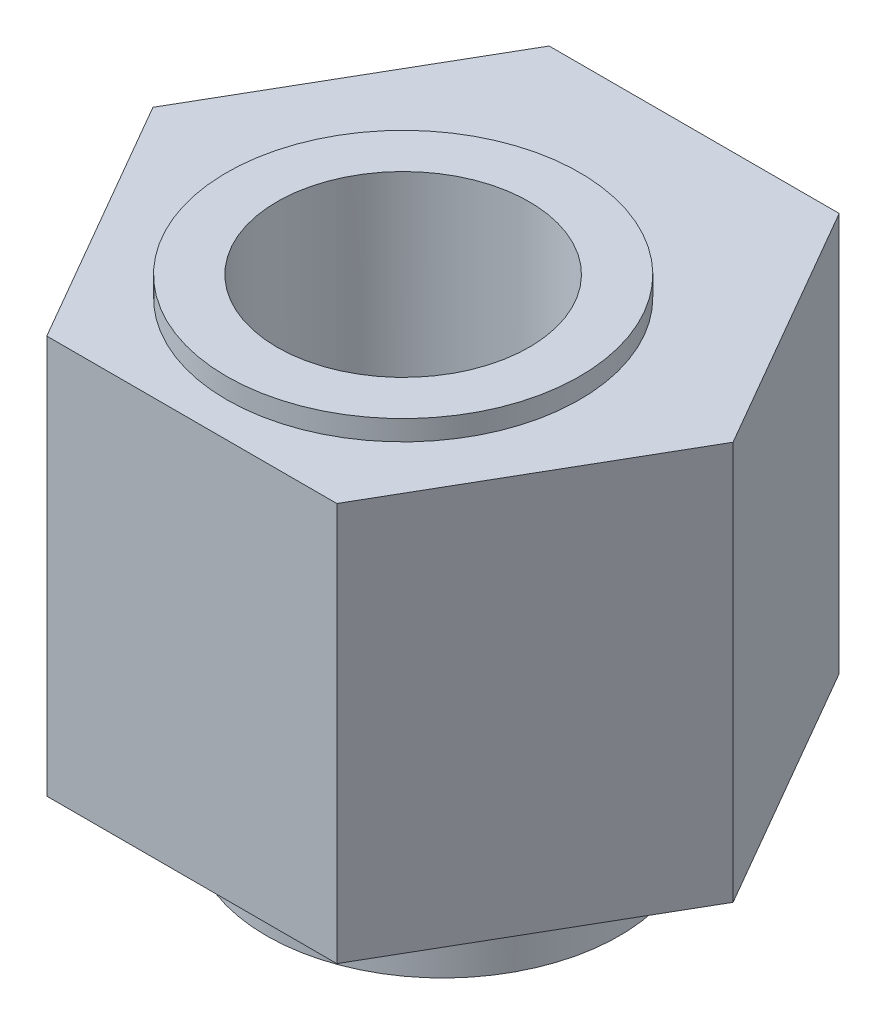
ISO-10303-21;
HEADER;
FILE_DESCRIPTION(('STEP AP214'),'2;1');
FILE_NAME('part.step','',(''),(''),'','','');
FILE_SCHEMA(('AUTOMOTIVE_DESIGN { 1 0 10303 214 1 1 1 1 }'));
ENDSEC;
DATA;
#1=APPLICATION_CONTEXT('core data for automotive mechanical design processes');
#2=APPLICATION_PROTOCOL_DEFINITION('international standard','automotive_design',2000,#1);
#3=PRODUCT_CONTEXT('',#1,'mechanical');
#4=PRODUCT('Part','Part','',(#3));
#5=PRODUCT_RELATED_PRODUCT_CATEGORY('part','',(#4));
#6=PRODUCT_DEFINITION_FORMATION('','',#4);
#7=PRODUCT_DEFINITION_CONTEXT('part definition',#1,'design');
#8=PRODUCT_DEFINITION('design','',#6,#7);
#9=PRODUCT_DEFINITION_SHAPE('','',#8);
#10=(LENGTH_UNIT() NAMED_UNIT(*) SI_UNIT(.MILLI.,.METRE.));
#11=(NAMED_UNIT(*) PLANE_ANGLE_UNIT() SI_UNIT($,.RADIAN.));
#12=(NAMED_UNIT(*) SI_UNIT($,.STERADIAN.) SOLID_ANGLE_UNIT());
#13=UNCERTAINTY_MEASURE_WITH_UNIT(LENGTH_MEASURE(1.E-05),#10,'distance_accuracy_value','');
#14=(GEOMETRIC_REPRESENTATION_CONTEXT(3) GLOBAL_UNCERTAINTY_ASSIGNED_CONTEXT((#13)) GLOBAL_UNIT_ASSIGNED_CONTEXT((#10,
#11,#12)) REPRESENTATION_CONTEXT('',''));
#15=CARTESIAN_POINT('',(0.,0.,0.));
#16=DIRECTION('',(0.,0.,1.));
#17=DIRECTION('',(1.,0.,0.));
#18=AXIS2_PLACEMENT_3D('',#15,#16,#17);
#19=CARTESIAN_POINT('',(0.,0.,0.));
#20=DIRECTION('',(0.,1.,0.));
#21=DIRECTION('',(0.,0.,1.));
#22=AXIS2_PLACEMENT_3D('',#19,#20,#21);
#23=PLANE('',#22);
#24=DIRECTION('',(0.5,0.,-0.866025403784439));
#25=VECTOR('',#24,1.);
#26=CARTESIAN_POINT('',(2.87520434056434,0.,4.98));
#27=LINE('',#26,#25);
#28=CARTESIAN_POINT('',(2.87520434056434,0.,4.98));
#29=VERTEX_POINT('',#28);
#30=CARTESIAN_POINT('',(5.75040868112867,0.,0.));
#31=VERTEX_POINT('',#30);
#32=EDGE_CURVE('E121',#29,#31,#27,.T.);
#33=ORIENTED_EDGE('',*,*,#32,.F.);
#34=DIRECTION('',(1.,0.,0.));
#35=VECTOR('',#34,1.);
#36=CARTESIAN_POINT('',(-2.87520434056433,0.,4.98));
#37=LINE('',#36,#35);
#38=CARTESIAN_POINT('',(-2.87520434056433,0.,4.98));
#39=VERTEX_POINT('',#38);
#40=EDGE_CURVE('E80',#39,#29,#37,.T.);
#41=ORIENTED_EDGE('',*,*,#40,.F.);
#42=DIRECTION('',(0.5,0.,0.866025403784439));
#43=VECTOR('',#42,1.);
#44=CARTESIAN_POINT('',(-5.75040868112867,0.,0.));
#45=LINE('',#44,#43);
#46=CARTESIAN_POINT('',(-5.75040868112867,0.,0.));
#47=VERTEX_POINT('',#46);
#48=EDGE_CURVE('E74',#47,#39,#45,.T.);
#49=ORIENTED_EDGE('',*,*,#48,.F.);
#50=DIRECTION('',(-0.5,0.,0.866025403784439));
#51=VECTOR('',#50,1.);
#52=CARTESIAN_POINT('',(-2.87520434056433,0.,-4.98));
#53=LINE('',#52,#51);
#54=CARTESIAN_POINT('',(-2.87520434056433,0.,-4.98));
#55=VERTEX_POINT('',#54);
#56=EDGE_CURVE('E111',#55,#47,#53,.T.);
#57=ORIENTED_EDGE('',*,*,#56,.F.);
#58=DIRECTION('',(-1.,0.,0.));
#59=VECTOR('',#58,1.);
#60=CARTESIAN_POINT('',(2.87520434056434,0.,-4.98));
#61=LINE('',#60,#59);
#62=CARTESIAN_POINT('',(2.87520434056434,0.,-4.98));
#63=VERTEX_POINT('',#62);
#64=EDGE_CURVE('E127',#63,#55,#61,.T.);
#65=ORIENTED_EDGE('',*,*,#64,.F.);
#66=DIRECTION('',(-0.5,0.,-0.866025403784438));
#67=VECTOR('',#66,1.);
#68=CARTESIAN_POINT('',(5.75040868112867,0.,0.));
#69=LINE('',#68,#67);
#70=EDGE_CURVE('E124',#31,#63,#69,.T.);
#71=ORIENTED_EDGE('',*,*,#70,.F.);
#72=EDGE_LOOP('',(#33,#41,#49,#57,#65,#71));
#73=FACE_BOUND('',#72,.T.);
#74=CARTESIAN_POINT('',(0.,0.,0.));
#75=DIRECTION('',(0.,1.,0.));
#76=DIRECTION('',(0.,0.,1.));
#77=AXIS2_PLACEMENT_3D('',#74,#75,#76);
#78=CIRCLE('',#77,3.5);
#79=CARTESIAN_POINT('',(0.,0.,3.5));
#80=VERTEX_POINT('',#79);
#81=EDGE_CURVE('E11',#80,#80,#78,.F.);
#82=ORIENTED_EDGE('',*,*,#81,.F.);
#83=EDGE_LOOP('',(#82));
#84=FACE_BOUND('',#83,.T.);
#85=ADVANCED_FACE('F34',(#73,#84),#23,.F.);
#86=CARTESIAN_POINT('',(0.,7.9,0.));
#87=DIRECTION('',(0.,1.,0.));
#88=DIRECTION('',(0.,0.,1.));
#89=AXIS2_PLACEMENT_3D('',#86,#87,#88);
#90=PLANE('',#89);
#91=DIRECTION('',(0.5,0.,-0.866025403784439));
#92=VECTOR('',#91,1.);
#93=CARTESIAN_POINT('',(2.87520434056434,7.9,4.98));
#94=LINE('',#93,#92);
#95=CARTESIAN_POINT('',(2.87520434056434,7.9,4.98));
#96=VERTEX_POINT('',#95);
#97=CARTESIAN_POINT('',(5.75040868112867,7.9,0.));
#98=VERTEX_POINT('',#97);
#99=EDGE_CURVE('E132',#96,#98,#94,.T.);
#100=ORIENTED_EDGE('',*,*,#99,.T.);
#101=DIRECTION('',(-0.5,0.,-0.866025403784438));
#102=VECTOR('',#101,1.);
#103=CARTESIAN_POINT('',(5.75040868112867,7.9,0.));
#104=LINE('',#103,#102);
#105=CARTESIAN_POINT('',(2.87520434056434,7.9,-4.98));
#106=VERTEX_POINT('',#105);
#107=EDGE_CURVE('E89',#98,#106,#104,.T.);
#108=ORIENTED_EDGE('',*,*,#107,.T.);
#109=DIRECTION('',(-1.,0.,0.));
#110=VECTOR('',#109,1.);
#111=CARTESIAN_POINT('',(2.87520434056434,7.9,-4.98));
#112=LINE('',#111,#110);
#113=CARTESIAN_POINT('',(-2.87520434056433,7.9,-4.98));
#114=VERTEX_POINT('',#113);
#115=EDGE_CURVE('E103',#106,#114,#112,.T.);
#116=ORIENTED_EDGE('',*,*,#115,.T.);
#117=DIRECTION('',(-0.5,0.,0.866025403784439));
#118=VECTOR('',#117,1.);
#119=CARTESIAN_POINT('',(-2.87520434056433,7.9,-4.98));
#120=LINE('',#119,#118);
#121=CARTESIAN_POINT('',(-5.75040868112867,7.9,0.));
#122=VERTEX_POINT('',#121);
#123=EDGE_CURVE('E96',#114,#122,#120,.T.);
#124=ORIENTED_EDGE('',*,*,#123,.T.);
#125=DIRECTION('',(0.5,0.,0.866025403784439));
#126=VECTOR('',#125,1.);
#127=CARTESIAN_POINT('',(-5.75040868112867,7.9,0.));
#128=LINE('',#127,#126);
#129=CARTESIAN_POINT('',(-2.87520434056433,7.9,4.98));
#130=VERTEX_POINT('',#129);
#131=EDGE_CURVE('E101',#122,#130,#128,.T.);
#132=ORIENTED_EDGE('',*,*,#131,.T.);
#133=DIRECTION('',(1.,0.,0.));
#134=VECTOR('',#133,1.);
#135=CARTESIAN_POINT('',(-2.87520434056433,7.9,4.98));
#136=LINE('',#135,#134);
#137=EDGE_CURVE('E51',#130,#96,#136,.T.);
#138=ORIENTED_EDGE('',*,*,#137,.T.);
#139=EDGE_LOOP('',(#100,#108,#116,#124,#132,#138));
#140=FACE_BOUND('',#139,.T.);
#141=CARTESIAN_POINT('',(0.,7.9,0.79));
#142=DIRECTION('',(0.,1.,0.));
#143=DIRECTION('',(0.,0.,1.));
#144=AXIS2_PLACEMENT_3D('',#141,#142,#143);
#145=CIRCLE('',#144,3.5);
#146=CARTESIAN_POINT('',(0.,7.9,4.29));
#147=VERTEX_POINT('',#146);
#148=EDGE_CURVE('E151',#147,#147,#145,.T.);
#149=ORIENTED_EDGE('',*,*,#148,.F.);
#150=EDGE_LOOP('',(#149));
#151=FACE_BOUND('',#150,.T.);
#152=ADVANCED_FACE('F98',(#140,#151),#90,.T.);
#153=CARTESIAN_POINT('',(2.87520434056434,7.9,4.98));
#154=DIRECTION('',(-0.866025403784439,0.,-0.5));
#155=DIRECTION('',(-0.5,0.,0.866025403784439));
#156=AXIS2_PLACEMENT_3D('',#153,#154,#155);
#157=PLANE('',#156);
#158=ORIENTED_EDGE('',*,*,#32,.T.);
#159=DIRECTION('',(0.,-1.,0.));
#160=VECTOR('',#159,1.);
#161=CARTESIAN_POINT('',(5.75040868112867,7.9,0.));
#162=LINE('',#161,#160);
#163=EDGE_CURVE('E43',#98,#31,#162,.T.);
#164=ORIENTED_EDGE('',*,*,#163,.F.);
#165=ORIENTED_EDGE('',*,*,#99,.F.);
#166=DIRECTION('',(0.,-1.,0.));
#167=VECTOR('',#166,1.);
#168=CARTESIAN_POINT('',(2.87520434056434,7.9,4.98));
#169=LINE('',#168,#167);
#170=EDGE_CURVE('E117',#96,#29,#169,.T.);
#171=ORIENTED_EDGE('',*,*,#170,.T.);
#172=EDGE_LOOP('',(#158,#164,#165,#171));
#173=FACE_BOUND('',#172,.T.);
#174=ADVANCED_FACE('F36',(#173),#157,.F.);
#175=CARTESIAN_POINT('',(5.75040868112867,7.9,0.));
#176=DIRECTION('',(-0.866025403784438,0.,0.5));
#177=DIRECTION('',(0.5,0.,0.866025403784438));
#178=AXIS2_PLACEMENT_3D('',#175,#176,#177);
#179=PLANE('',#178);
#180=ORIENTED_EDGE('',*,*,#70,.T.);
#181=DIRECTION('',(0.,-1.,0.));
#182=VECTOR('',#181,1.);
#183=CARTESIAN_POINT('',(2.87520434056434,7.9,-4.98));
#184=LINE('',#183,#182);
#185=EDGE_CURVE('E136',#106,#63,#184,.T.);
#186=ORIENTED_EDGE('',*,*,#185,.F.);
#187=ORIENTED_EDGE('',*,*,#107,.F.);
#188=ORIENTED_EDGE('',*,*,#163,.T.);
#189=EDGE_LOOP('',(#180,#186,#187,#188));
#190=FACE_BOUND('',#189,.T.);
#191=ADVANCED_FACE('F139',(#190),#179,.F.);
#192=CARTESIAN_POINT('',(2.87520434056434,7.9,-4.98));
#193=DIRECTION('',(0.,0.,1.));
#194=DIRECTION('',(1.,0.,0.));
#195=AXIS2_PLACEMENT_3D('',#192,#193,#194);
#196=PLANE('',#195);
#197=ORIENTED_EDGE('',*,*,#64,.T.);
#198=DIRECTION('',(0.,-1.,0.));
#199=VECTOR('',#198,1.);
#200=CARTESIAN_POINT('',(-2.87520434056433,7.9,-4.98));
#201=LINE('',#200,#199);
#202=EDGE_CURVE('E112',#114,#55,#201,.T.);
#203=ORIENTED_EDGE('',*,*,#202,.F.);
#204=ORIENTED_EDGE('',*,*,#115,.F.);
#205=ORIENTED_EDGE('',*,*,#185,.T.);
#206=EDGE_LOOP('',(#197,#203,#204,#205));
#207=FACE_BOUND('',#206,.T.);
#208=ADVANCED_FACE('F147',(#207),#196,.F.);
#209=CARTESIAN_POINT('',(-2.87520434056433,7.9,-4.98));
#210=DIRECTION('',(0.866025403784439,0.,0.5));
#211=DIRECTION('',(0.5,0.,-0.866025403784439));
#212=AXIS2_PLACEMENT_3D('',#209,#210,#211);
#213=PLANE('',#212);
#214=ORIENTED_EDGE('',*,*,#56,.T.);
#215=DIRECTION('',(0.,-1.,0.));
#216=VECTOR('',#215,1.);
#217=CARTESIAN_POINT('',(-5.75040868112867,7.9,0.));
#218=LINE('',#217,#216);
#219=EDGE_CURVE('E108',#122,#47,#218,.T.);
#220=ORIENTED_EDGE('',*,*,#219,.F.);
#221=ORIENTED_EDGE('',*,*,#123,.F.);
#222=ORIENTED_EDGE('',*,*,#202,.T.);
#223=EDGE_LOOP('',(#214,#220,#221,#222));
#224=FACE_BOUND('',#223,.T.);
#225=ADVANCED_FACE('F109',(#224),#213,.F.);
#226=CARTESIAN_POINT('',(-5.75040868112867,7.9,0.));
#227=DIRECTION('',(0.866025403784439,0.,-0.5));
#228=DIRECTION('',(-0.5,0.,-0.866025403784439));
#229=AXIS2_PLACEMENT_3D('',#226,#227,#228);
#230=PLANE('',#229);
#231=ORIENTED_EDGE('',*,*,#48,.T.);
#232=DIRECTION('',(0.,-1.,0.));
#233=VECTOR('',#232,1.);
#234=CARTESIAN_POINT('',(-2.87520434056433,7.9,4.98));
#235=LINE('',#234,#233);
#236=EDGE_CURVE('E113',#130,#39,#235,.T.);
#237=ORIENTED_EDGE('',*,*,#236,.F.);
#238=ORIENTED_EDGE('',*,*,#131,.F.);
#239=ORIENTED_EDGE('',*,*,#219,.T.);
#240=EDGE_LOOP('',(#231,#237,#238,#239));
#241=FACE_BOUND('',#240,.T.);
#242=ADVANCED_FACE('F115',(#241),#230,.F.);
#243=CARTESIAN_POINT('',(-2.87520434056433,7.9,4.98));
#244=DIRECTION('',(0.,0.,-1.));
#245=DIRECTION('',(-1.,0.,0.));
#246=AXIS2_PLACEMENT_3D('',#243,#244,#245);
#247=PLANE('',#246);
#248=ORIENTED_EDGE('',*,*,#40,.T.);
#249=ORIENTED_EDGE('',*,*,#170,.F.);
#250=ORIENTED_EDGE('',*,*,#137,.F.);
#251=ORIENTED_EDGE('',*,*,#236,.T.);
#252=EDGE_LOOP('',(#248,#249,#250,#251));
#253=FACE_BOUND('',#252,.T.);
#254=ADVANCED_FACE('F191',(#253),#247,.F.);
#255=CARTESIAN_POINT('',(0.,0.,0.79));
#256=DIRECTION('',(0.,1.,0.));
#257=DIRECTION('',(0.,0.,1.));
#258=AXIS2_PLACEMENT_3D('',#255,#256,#257);
#259=CYLINDRICAL_SURFACE('',#258,2.5);
#260=CARTESIAN_POINT('',(0.,8.3,0.79));
#261=DIRECTION('',(0.,1.,0.));
#262=DIRECTION('',(0.,0.,1.));
#263=AXIS2_PLACEMENT_3D('',#260,#261,#262);
#264=CIRCLE('',#263,2.5);
#265=CARTESIAN_POINT('',(0.,8.3,3.29));
#266=VERTEX_POINT('',#265);
#267=EDGE_CURVE('E154',#266,#266,#264,.T.);
#268=ORIENTED_EDGE('',*,*,#267,.T.);
#269=EDGE_LOOP('',(#268));
#270=FACE_BOUND('',#269,.T.);
#271=CARTESIAN_POINT('',(0.,-1.7,0.79));
#272=DIRECTION('',(0.,-1.,0.));
#273=DIRECTION('',(0.,0.,-1.));
#274=AXIS2_PLACEMENT_3D('',#271,#272,#273);
#275=CIRCLE('',#274,2.5);
#276=CARTESIAN_POINT('',(0.,-1.7,-1.71));
#277=VERTEX_POINT('',#276);
#278=EDGE_CURVE('E162',#277,#277,#275,.T.);
#279=ORIENTED_EDGE('',*,*,#278,.T.);
#280=EDGE_LOOP('',(#279));
#281=FACE_BOUND('',#280,.T.);
#282=ADVANCED_FACE('F166',(#270,#281),#259,.F.);
#283=CARTESIAN_POINT('',(0.,8.3,0.79));
#284=DIRECTION('',(0.,1.,0.));
#285=DIRECTION('',(0.,0.,1.));
#286=AXIS2_PLACEMENT_3D('',#283,#284,#285);
#287=PLANE('',#286);
#288=CARTESIAN_POINT('',(0.,8.3,0.79));
#289=DIRECTION('',(0.,1.,0.));
#290=DIRECTION('',(0.,0.,1.));
#291=AXIS2_PLACEMENT_3D('',#288,#289,#290);
#292=CIRCLE('',#291,3.5);
#293=CARTESIAN_POINT('',(0.,8.3,4.29));
#294=VERTEX_POINT('',#293);
#295=EDGE_CURVE('E125',#294,#294,#292,.T.);
#296=ORIENTED_EDGE('',*,*,#295,.T.);
#297=EDGE_LOOP('',(#296));
#298=FACE_BOUND('',#297,.T.);
#299=ORIENTED_EDGE('',*,*,#267,.F.);
#300=EDGE_LOOP('',(#299));
#301=FACE_BOUND('',#300,.T.);
#302=ADVANCED_FACE('F180',(#298,#301),#287,.T.);
#303=CARTESIAN_POINT('',(0.,8.3,0.79));
#304=DIRECTION('',(0.,-1.,0.));
#305=DIRECTION('',(0.,0.,-1.));
#306=AXIS2_PLACEMENT_3D('',#303,#304,#305);
#307=CYLINDRICAL_SURFACE('',#306,3.5);
#308=ORIENTED_EDGE('',*,*,#295,.F.);
#309=EDGE_LOOP('',(#308));
#310=FACE_BOUND('',#309,.T.);
#311=ORIENTED_EDGE('',*,*,#148,.T.);
#312=EDGE_LOOP('',(#311));
#313=FACE_BOUND('',#312,.T.);
#314=ADVANCED_FACE('F171',(#310,#313),#307,.T.);
#315=CARTESIAN_POINT('',(0.,-1.7,0.));
#316=DIRECTION('',(0.,-1.,0.));
#317=DIRECTION('',(0.,0.,-1.));
#318=AXIS2_PLACEMENT_3D('',#315,#316,#317);
#319=PLANE('',#318);
#320=CARTESIAN_POINT('',(0.,-1.7,0.));
#321=DIRECTION('',(0.,-1.,0.));
#322=DIRECTION('',(0.,0.,-1.));
#323=AXIS2_PLACEMENT_3D('',#320,#321,#322);
#324=CIRCLE('',#323,3.5);
#325=CARTESIAN_POINT('',(0.,-1.7,-3.5));
#326=VERTEX_POINT('',#325);
#327=EDGE_CURVE('E159',#326,#326,#324,.T.);
#328=ORIENTED_EDGE('',*,*,#327,.T.);
#329=EDGE_LOOP('',(#328));
#330=FACE_BOUND('',#329,.T.);
#331=ORIENTED_EDGE('',*,*,#278,.F.);
#332=EDGE_LOOP('',(#331));
#333=FACE_BOUND('',#332,.T.);
#334=ADVANCED_FACE('F168',(#330,#333),#319,.T.);
#335=CARTESIAN_POINT('',(0.,-1.7,0.));
#336=DIRECTION('',(0.,1.,0.));
#337=DIRECTION('',(0.,0.,1.));
#338=AXIS2_PLACEMENT_3D('',#335,#336,#337);
#339=CYLINDRICAL_SURFACE('',#338,3.5);
#340=ORIENTED_EDGE('',*,*,#327,.F.);
#341=EDGE_LOOP('',(#340));
#342=FACE_BOUND('',#341,.T.);
#343=ORIENTED_EDGE('',*,*,#81,.T.);
#344=EDGE_LOOP('',(#343));
#345=FACE_BOUND('',#344,.T.);
#346=ADVANCED_FACE('F170',(#342,#345),#339,.T.);
#347=CLOSED_SHELL('',(#85,#152,#174,#191,#208,#225,#242,#254,#282,#302,#314,#334,#346));
#348=MANIFOLD_SOLID_BREP('B2',#347);
#349=ADVANCED_BREP_SHAPE_REPRESENTATION('',(#18,#348),#14);
#350=SHAPE_DEFINITION_REPRESENTATION(#9,#349);
ENDSEC;
END-ISO-10303-21;
